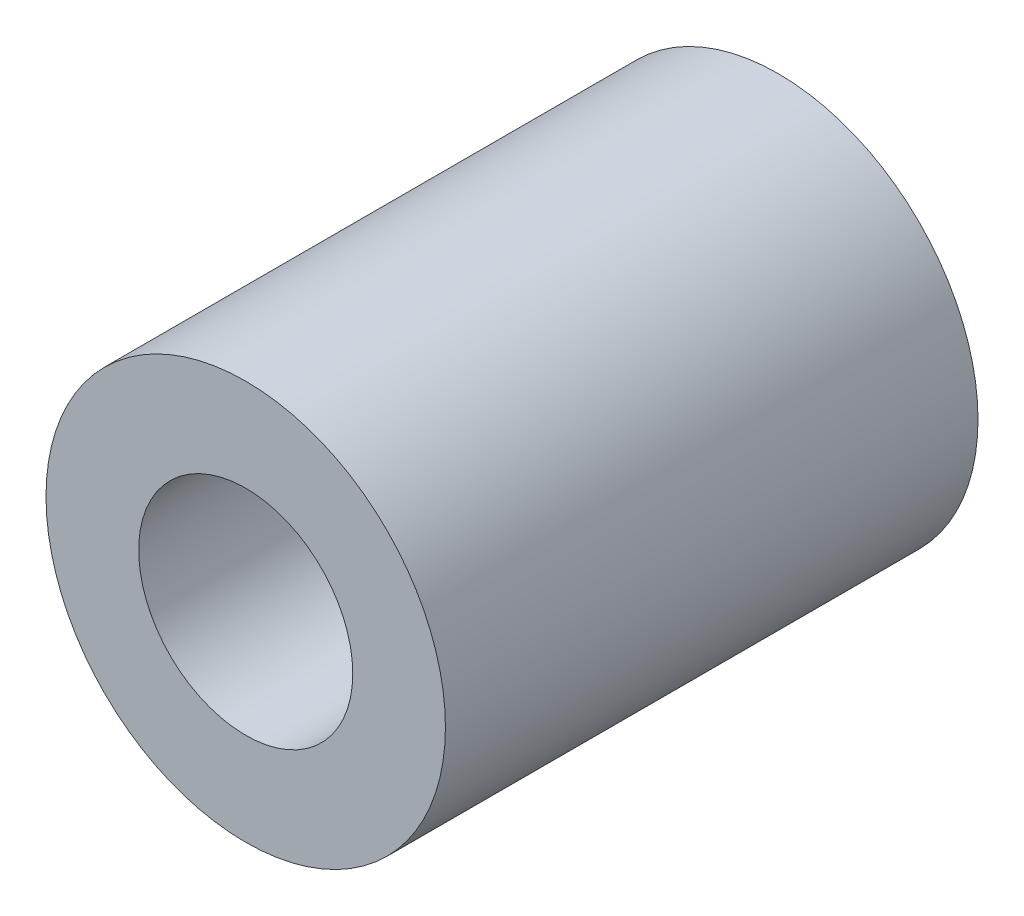
ISO-10303-21;
HEADER;
FILE_DESCRIPTION(('STEP AP214'),'2;1');
FILE_NAME('part.step','',(''),(''),'','','');
FILE_SCHEMA(('AUTOMOTIVE_DESIGN { 1 0 10303 214 1 1 1 1 }'));
ENDSEC;
DATA;
#1=APPLICATION_CONTEXT('core data for automotive mechanical design processes');
#2=APPLICATION_PROTOCOL_DEFINITION('international standard','automotive_design',2000,#1);
#3=PRODUCT_CONTEXT('',#1,'mechanical');
#4=PRODUCT('Part','Part','',(#3));
#5=PRODUCT_RELATED_PRODUCT_CATEGORY('part','',(#4));
#6=PRODUCT_DEFINITION_FORMATION('','',#4);
#7=PRODUCT_DEFINITION_CONTEXT('part definition',#1,'design');
#8=PRODUCT_DEFINITION('design','',#6,#7);
#9=PRODUCT_DEFINITION_SHAPE('','',#8);
#10=(LENGTH_UNIT() NAMED_UNIT(*) SI_UNIT(.MILLI.,.METRE.));
#11=(NAMED_UNIT(*) PLANE_ANGLE_UNIT() SI_UNIT($,.RADIAN.));
#12=(NAMED_UNIT(*) SI_UNIT($,.STERADIAN.) SOLID_ANGLE_UNIT());
#13=UNCERTAINTY_MEASURE_WITH_UNIT(LENGTH_MEASURE(1.E-05),#10,'distance_accuracy_value','');
#14=(GEOMETRIC_REPRESENTATION_CONTEXT(3) GLOBAL_UNCERTAINTY_ASSIGNED_CONTEXT((#13)) GLOBAL_UNIT_ASSIGNED_CONTEXT((#10,
#11,#12)) REPRESENTATION_CONTEXT('',''));
#15=CARTESIAN_POINT('',(0.,0.,0.));
#16=DIRECTION('',(0.,0.,1.));
#17=DIRECTION('',(1.,0.,0.));
#18=AXIS2_PLACEMENT_3D('',#15,#16,#17);
#19=CARTESIAN_POINT('',(0.,0.,12.7));
#20=DIRECTION('',(0.,0.,1.));
#21=DIRECTION('',(1.,0.,0.));
#22=AXIS2_PLACEMENT_3D('',#19,#20,#21);
#23=PLANE('',#22);
#24=CARTESIAN_POINT('',(0.,0.,12.7));
#25=DIRECTION('',(0.,0.,1.));
#26=DIRECTION('',(1.,0.,0.));
#27=AXIS2_PLACEMENT_3D('',#24,#25,#26);
#28=CIRCLE('',#27,4.7625);
#29=CARTESIAN_POINT('',(4.7625,0.,12.7));
#30=VERTEX_POINT('',#29);
#31=EDGE_CURVE('E10',#30,#30,#28,.T.);
#32=ORIENTED_EDGE('',*,*,#31,.T.);
#33=EDGE_LOOP('',(#32));
#34=FACE_BOUND('',#33,.T.);
#35=CARTESIAN_POINT('',(0.,0.,12.7));
#36=DIRECTION('',(0.,0.,1.));
#37=DIRECTION('',(1.,0.,0.));
#38=AXIS2_PLACEMENT_3D('',#35,#36,#37);
#39=CIRCLE('',#38,2.5527);
#40=CARTESIAN_POINT('',(2.5527,0.,12.7));
#41=VERTEX_POINT('',#40);
#42=EDGE_CURVE('E42',#41,#41,#39,.T.);
#43=ORIENTED_EDGE('',*,*,#42,.F.);
#44=EDGE_LOOP('',(#43));
#45=FACE_BOUND('',#44,.T.);
#46=ADVANCED_FACE('F31',(#34,#45),#23,.T.);
#47=CARTESIAN_POINT('',(0.,0.,0.));
#48=DIRECTION('',(0.,0.,1.));
#49=DIRECTION('',(1.,0.,0.));
#50=AXIS2_PLACEMENT_3D('',#47,#48,#49);
#51=PLANE('',#50);
#52=CARTESIAN_POINT('',(0.,0.,0.));
#53=DIRECTION('',(0.,0.,1.));
#54=DIRECTION('',(1.,0.,0.));
#55=AXIS2_PLACEMENT_3D('',#52,#53,#54);
#56=CIRCLE('',#55,4.7625);
#57=CARTESIAN_POINT('',(4.7625,0.,0.));
#58=VERTEX_POINT('',#57);
#59=EDGE_CURVE('E35',#58,#58,#56,.T.);
#60=ORIENTED_EDGE('',*,*,#59,.F.);
#61=EDGE_LOOP('',(#60));
#62=FACE_BOUND('',#61,.T.);
#63=CARTESIAN_POINT('',(0.,0.,0.));
#64=DIRECTION('',(0.,0.,1.));
#65=DIRECTION('',(1.,0.,0.));
#66=AXIS2_PLACEMENT_3D('',#63,#64,#65);
#67=CIRCLE('',#66,2.5527);
#68=CARTESIAN_POINT('',(2.5527,0.,0.));
#69=VERTEX_POINT('',#68);
#70=EDGE_CURVE('E44',#69,#69,#67,.T.);
#71=ORIENTED_EDGE('',*,*,#70,.T.);
#72=EDGE_LOOP('',(#71));
#73=FACE_BOUND('',#72,.T.);
#74=ADVANCED_FACE('F54',(#62,#73),#51,.F.);
#75=CARTESIAN_POINT('',(0.,0.,12.7));
#76=DIRECTION('',(0.,0.,-1.));
#77=DIRECTION('',(-1.,0.,0.));
#78=AXIS2_PLACEMENT_3D('',#75,#76,#77);
#79=CYLINDRICAL_SURFACE('',#78,4.7625);
#80=ORIENTED_EDGE('',*,*,#31,.F.);
#81=EDGE_LOOP('',(#80));
#82=FACE_BOUND('',#81,.T.);
#83=ORIENTED_EDGE('',*,*,#59,.T.);
#84=EDGE_LOOP('',(#83));
#85=FACE_BOUND('',#84,.T.);
#86=ADVANCED_FACE('F33',(#82,#85),#79,.T.);
#87=CARTESIAN_POINT('',(0.,0.,12.7));
#88=DIRECTION('',(0.,0.,-1.));
#89=DIRECTION('',(-1.,0.,0.));
#90=AXIS2_PLACEMENT_3D('',#87,#88,#89);
#91=CYLINDRICAL_SURFACE('',#90,2.5527);
#92=ORIENTED_EDGE('',*,*,#42,.T.);
#93=EDGE_LOOP('',(#92));
#94=FACE_BOUND('',#93,.T.);
#95=ORIENTED_EDGE('',*,*,#70,.F.);
#96=EDGE_LOOP('',(#95));
#97=FACE_BOUND('',#96,.T.);
#98=ADVANCED_FACE('F50',(#94,#97),#91,.F.);
#99=CLOSED_SHELL('',(#46,#74,#86,#98));
#100=MANIFOLD_SOLID_BREP('B2',#99);
#101=ADVANCED_BREP_SHAPE_REPRESENTATION('',(#18,#100),#14);
#102=SHAPE_DEFINITION_REPRESENTATION(#9,#101);
ENDSEC;
END-ISO-10303-21;
